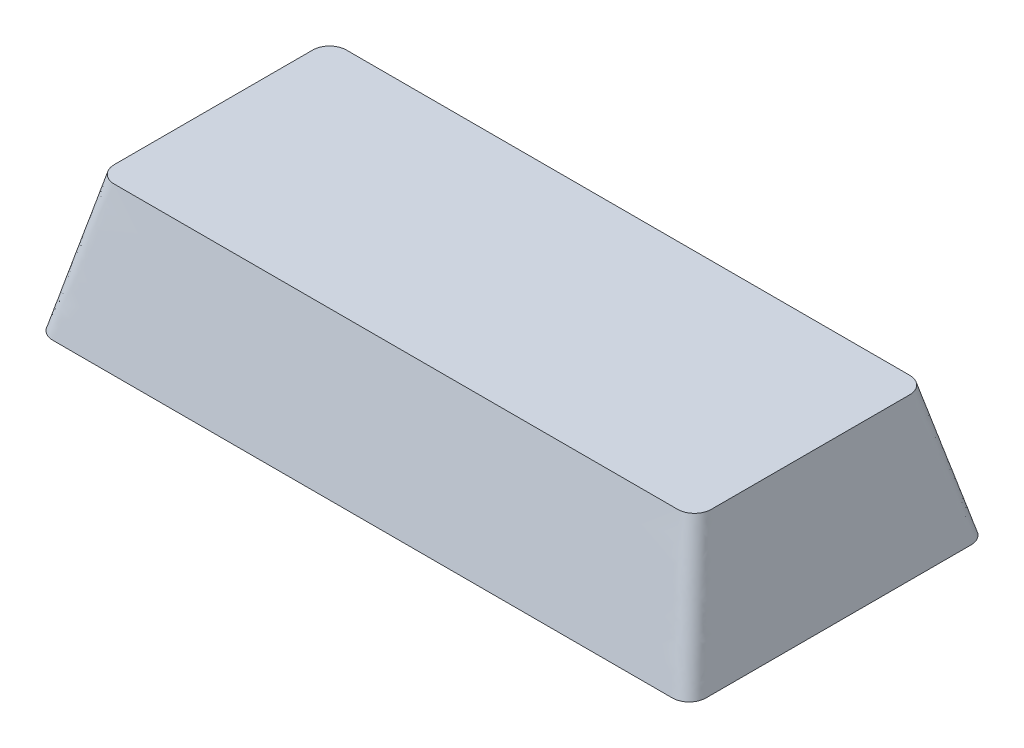
ISO-10303-21;
HEADER;
FILE_DESCRIPTION(('STEP AP214'),'2;1');
FILE_NAME('part.step','',(''),(''),'','','');
FILE_SCHEMA(('AUTOMOTIVE_DESIGN { 1 0 10303 214 1 1 1 1 }'));
ENDSEC;
DATA;
#1=APPLICATION_CONTEXT('core data for automotive mechanical design processes');
#2=APPLICATION_PROTOCOL_DEFINITION('international standard','automotive_design',2000,#1);
#3=PRODUCT_CONTEXT('',#1,'mechanical');
#4=PRODUCT('Part','Part','',(#3));
#5=PRODUCT_RELATED_PRODUCT_CATEGORY('part','',(#4));
#6=PRODUCT_DEFINITION_FORMATION('','',#4);
#7=PRODUCT_DEFINITION_CONTEXT('part definition',#1,'design');
#8=PRODUCT_DEFINITION('design','',#6,#7);
#9=PRODUCT_DEFINITION_SHAPE('','',#8);
#10=(LENGTH_UNIT() NAMED_UNIT(*) SI_UNIT(.MILLI.,.METRE.));
#11=(NAMED_UNIT(*) PLANE_ANGLE_UNIT() SI_UNIT($,.RADIAN.));
#12=(NAMED_UNIT(*) SI_UNIT($,.STERADIAN.) SOLID_ANGLE_UNIT());
#13=UNCERTAINTY_MEASURE_WITH_UNIT(LENGTH_MEASURE(1.E-05),#10,'distance_accuracy_value','');
#14=(GEOMETRIC_REPRESENTATION_CONTEXT(3) GLOBAL_UNCERTAINTY_ASSIGNED_CONTEXT((#13)) GLOBAL_UNIT_ASSIGNED_CONTEXT((#10,
#11,#12)) REPRESENTATION_CONTEXT('',''));
#15=CARTESIAN_POINT('',(0.,0.,0.));
#16=DIRECTION('',(0.,0.,1.));
#17=DIRECTION('',(1.,0.,0.));
#18=AXIS2_PLACEMENT_3D('',#15,#16,#17);
#19=CARTESIAN_POINT('',(-18.669,0.,-7.9883));
#20=DIRECTION('',(0.,-1.,0.));
#21=DIRECTION('',(0.,0.,-1.));
#22=AXIS2_PLACEMENT_3D('',#19,#20,#21);
#23=PLANE('',#22);
#24=CARTESIAN_POINT('',(-18.669,0.,-7.9883));
#25=DIRECTION('',(0.,1.,0.));
#26=DIRECTION('',(0.,0.,-1.));
#27=AXIS2_PLACEMENT_3D('',#24,#25,#26);
#28=CIRCLE('',#27,1.016);
#29=CARTESIAN_POINT('',(-18.6689999999119,0.,-9.0043));
#30=VERTEX_POINT('',#29);
#31=CARTESIAN_POINT('',(-19.685,0.,-7.9883));
#32=VERTEX_POINT('',#31);
#33=EDGE_CURVE('E324',#30,#32,#28,.T.);
#34=ORIENTED_EDGE('',*,*,#33,.F.);
#35=DIRECTION('',(-1.,0.,0.));
#36=VECTOR('',#35,1.);
#37=CARTESIAN_POINT('',(-18.669,0.,-9.0043));
#38=LINE('',#37,#36);
#39=CARTESIAN_POINT('',(18.6689999999993,0.,-9.0043));
#40=VERTEX_POINT('',#39);
#41=EDGE_CURVE('E572',#40,#30,#38,.T.);
#42=ORIENTED_EDGE('',*,*,#41,.F.);
#43=CARTESIAN_POINT('',(18.669,0.,-7.9883));
#44=DIRECTION('',(0.,1.,0.));
#45=DIRECTION('',(0.,0.,-1.));
#46=AXIS2_PLACEMENT_3D('',#43,#44,#45);
#47=CIRCLE('',#46,1.016);
#48=CARTESIAN_POINT('',(19.685,0.,-7.98829999992185));
#49=VERTEX_POINT('',#48);
#50=EDGE_CURVE('E562',#49,#40,#47,.T.);
#51=ORIENTED_EDGE('',*,*,#50,.F.);
#52=DIRECTION('',(0.,0.,-1.));
#53=VECTOR('',#52,1.);
#54=CARTESIAN_POINT('',(19.685,0.,7.9883));
#55=LINE('',#54,#53);
#56=CARTESIAN_POINT('',(19.685,0.,7.98829999998992));
#57=VERTEX_POINT('',#56);
#58=EDGE_CURVE('E552',#57,#49,#55,.T.);
#59=ORIENTED_EDGE('',*,*,#58,.F.);
#60=CARTESIAN_POINT('',(18.669,0.,7.9883));
#61=DIRECTION('',(0.,1.,0.));
#62=DIRECTION('',(0.,0.,1.));
#63=AXIS2_PLACEMENT_3D('',#60,#61,#62);
#64=CIRCLE('',#63,1.016);
#65=CARTESIAN_POINT('',(18.6689999999116,0.,9.0043));
#66=VERTEX_POINT('',#65);
#67=EDGE_CURVE('E542',#66,#57,#64,.T.);
#68=ORIENTED_EDGE('',*,*,#67,.F.);
#69=DIRECTION('',(1.,0.,0.));
#70=VECTOR('',#69,1.);
#71=CARTESIAN_POINT('',(-18.669,0.,9.0043));
#72=LINE('',#71,#70);
#73=CARTESIAN_POINT('',(-18.6689999999993,0.,9.0043));
#74=VERTEX_POINT('',#73);
#75=EDGE_CURVE('E535',#74,#66,#72,.T.);
#76=ORIENTED_EDGE('',*,*,#75,.F.);
#77=CARTESIAN_POINT('',(-18.669,0.,7.9883));
#78=DIRECTION('',(0.,1.,0.));
#79=DIRECTION('',(0.,0.,-1.));
#80=AXIS2_PLACEMENT_3D('',#77,#78,#79);
#81=CIRCLE('',#80,1.016);
#82=CARTESIAN_POINT('',(-19.685,0.,7.9883));
#83=VERTEX_POINT('',#82);
#84=EDGE_CURVE('E255',#83,#74,#81,.T.);
#85=ORIENTED_EDGE('',*,*,#84,.F.);
#86=DIRECTION('',(0.,0.,1.));
#87=VECTOR('',#86,1.);
#88=CARTESIAN_POINT('',(-19.685,0.,7.9883));
#89=LINE('',#88,#87);
#90=EDGE_CURVE('E13',#32,#83,#89,.T.);
#91=ORIENTED_EDGE('',*,*,#90,.F.);
#92=EDGE_LOOP('',(#34,#42,#51,#59,#68,#76,#85,#91));
#93=FACE_BOUND('',#92,.T.);
#94=ADVANCED_FACE('F244',(#93),#23,.T.);
#95=CARTESIAN_POINT('',(16.9799,8.001,-5.9817));
#96=DIRECTION('',(0.,-1.,0.));
#97=DIRECTION('',(0.,0.,-1.));
#98=AXIS2_PLACEMENT_3D('',#95,#96,#97);
#99=PLANE('',#98);
#100=CARTESIAN_POINT('',(16.9799,8.001,-5.9817));
#101=DIRECTION('',(0.,1.,0.));
#102=DIRECTION('',(0.,0.,-1.));
#103=AXIS2_PLACEMENT_3D('',#100,#101,#102);
#104=CIRCLE('',#103,1.016);
#105=CARTESIAN_POINT('',(17.9959,8.001,-5.98169999999999));
#106=VERTEX_POINT('',#105);
#107=CARTESIAN_POINT('',(16.9799,8.001,-6.9977));
#108=VERTEX_POINT('',#107);
#109=EDGE_CURVE('E319',#106,#108,#104,.T.);
#110=ORIENTED_EDGE('',*,*,#109,.T.);
#111=DIRECTION('',(-1.,0.,0.));
#112=VECTOR('',#111,1.);
#113=CARTESIAN_POINT('',(-16.9799,8.001,-6.9977));
#114=LINE('',#113,#112);
#115=CARTESIAN_POINT('',(-16.9799,8.001,-6.9977));
#116=VERTEX_POINT('',#115);
#117=EDGE_CURVE('E310',#108,#116,#114,.T.);
#118=ORIENTED_EDGE('',*,*,#117,.T.);
#119=CARTESIAN_POINT('',(-16.9799,8.001,-5.9817));
#120=DIRECTION('',(0.,1.,0.));
#121=DIRECTION('',(0.,0.,-1.));
#122=AXIS2_PLACEMENT_3D('',#119,#120,#121);
#123=CIRCLE('',#122,1.016);
#124=CARTESIAN_POINT('',(-17.9959,8.001,-5.98169999999999));
#125=VERTEX_POINT('',#124);
#126=EDGE_CURVE('E315',#116,#125,#123,.T.);
#127=ORIENTED_EDGE('',*,*,#126,.T.);
#128=DIRECTION('',(0.,0.,1.));
#129=VECTOR('',#128,1.);
#130=CARTESIAN_POINT('',(-17.9959,8.001,5.98169999999999));
#131=LINE('',#130,#129);
#132=CARTESIAN_POINT('',(-17.9959,8.001,5.98169999999999));
#133=VERTEX_POINT('',#132);
#134=EDGE_CURVE('E331',#125,#133,#131,.T.);
#135=ORIENTED_EDGE('',*,*,#134,.T.);
#136=CARTESIAN_POINT('',(-16.9799,8.001,5.9817));
#137=DIRECTION('',(0.,1.,0.));
#138=DIRECTION('',(0.,0.,-1.));
#139=AXIS2_PLACEMENT_3D('',#136,#137,#138);
#140=CIRCLE('',#139,1.016);
#141=CARTESIAN_POINT('',(-16.9799,8.001,6.9977));
#142=VERTEX_POINT('',#141);
#143=EDGE_CURVE('E471',#133,#142,#140,.T.);
#144=ORIENTED_EDGE('',*,*,#143,.T.);
#145=DIRECTION('',(1.,0.,0.));
#146=VECTOR('',#145,1.);
#147=CARTESIAN_POINT('',(-16.9799,8.001,6.9977));
#148=LINE('',#147,#146);
#149=CARTESIAN_POINT('',(16.9799,8.001,6.9977));
#150=VERTEX_POINT('',#149);
#151=EDGE_CURVE('E482',#142,#150,#148,.T.);
#152=ORIENTED_EDGE('',*,*,#151,.T.);
#153=CARTESIAN_POINT('',(16.9799,8.001,5.9817));
#154=DIRECTION('',(0.,1.,0.));
#155=DIRECTION('',(0.,0.,1.));
#156=AXIS2_PLACEMENT_3D('',#153,#154,#155);
#157=CIRCLE('',#156,1.016);
#158=CARTESIAN_POINT('',(17.9959,8.001,5.98169999999999));
#159=VERTEX_POINT('',#158);
#160=EDGE_CURVE('E485',#150,#159,#157,.T.);
#161=ORIENTED_EDGE('',*,*,#160,.T.);
#162=DIRECTION('',(0.,0.,-1.));
#163=VECTOR('',#162,1.);
#164=CARTESIAN_POINT('',(17.9959,8.001,5.98169999999999));
#165=LINE('',#164,#163);
#166=EDGE_CURVE('E503',#159,#106,#165,.T.);
#167=ORIENTED_EDGE('',*,*,#166,.T.);
#168=EDGE_LOOP('',(#110,#118,#127,#135,#144,#152,#161,#167));
#169=FACE_BOUND('',#168,.T.);
#170=ADVANCED_FACE('F314',(#169),#99,.F.);
#171=CARTESIAN_POINT('',(-16.9798999992069,8.001,-6.9977));
#172=CARTESIAN_POINT('',(-18.6689999991315,0.,-9.0043));
#173=CARTESIAN_POINT('',(-14.1442894390681,8.001,-6.9977));
#174=CARTESIAN_POINT('',(-15.5639740776614,0.,-9.0043));
#175=CARTESIAN_POINT('',(-8.48153394542982,8.00100000000001,-6.99769999999999));
#176=CARTESIAN_POINT('',(-9.34424108341826,0.,-9.0043));
#177=CARTESIAN_POINT('',(0.,8.00099999999999,-6.99770000000001));
#178=CARTESIAN_POINT('',(0.,0.,-9.00429999999999));
#179=CARTESIAN_POINT('',(8.4815339454298,8.001,-6.99769999999999));
#180=CARTESIAN_POINT('',(9.34424108341825,0.,-9.0043));
#181=CARTESIAN_POINT('',(14.1442894390681,8.001,-6.9977));
#182=CARTESIAN_POINT('',(15.5639740776614,0.,-9.0043));
#183=CARTESIAN_POINT('',(17.1072668605747,8.001,-6.9977));
#184=CARTESIAN_POINT('',(18.8084681657559,0.,-9.0043));
#185=CARTESIAN_POINT('',(17.3765771636546,8.001,-6.94866859660009));
#186=CARTESIAN_POINT('',(19.0707881960242,0.,-8.94785022253748));
#187=CARTESIAN_POINT('',(17.7352821964251,8.00099999999999,-6.70524238804379));
#188=CARTESIAN_POINT('',(19.3931178802567,0.,-8.73476289399683));
#189=CARTESIAN_POINT('',(17.9551707637829,8.00100000000001,-6.34797087880216));
#190=CARTESIAN_POINT('',(19.6194369617665,0.,-8.41454428049206));
#191=CARTESIAN_POINT('',(17.9959,8.001,-6.09860446192369));
#192=CARTESIAN_POINT('',(19.685,0.,-8.13980506673523));
#193=CARTESIAN_POINT('',(17.9959,8.001,-4.96866037368238));
#194=CARTESIAN_POINT('',(19.685,0.,-6.67542764538571));
#195=CARTESIAN_POINT('',(17.9959,8.001,-2.96728244688406));
#196=CARTESIAN_POINT('',(19.685,0.,-4.0224961699705));
#197=CARTESIAN_POINT('',(17.9959,8.001,0.));
#198=CARTESIAN_POINT('',(19.685,0.,0.));
#199=CARTESIAN_POINT('',(17.9959,8.001,2.96728244688407));
#200=CARTESIAN_POINT('',(19.685,0.,4.0224961699705));
#201=CARTESIAN_POINT('',(17.9959,8.001,4.96866037368238));
#202=CARTESIAN_POINT('',(19.685,0.,6.67542764538571));
#203=CARTESIAN_POINT('',(17.9959,8.001,6.09860446192369));
#204=CARTESIAN_POINT('',(19.685,0.,8.13980506673523));
#205=CARTESIAN_POINT('',(17.9551707637829,8.001,6.34797087880216));
#206=CARTESIAN_POINT('',(19.6194369617665,0.,8.41454428049207));
#207=CARTESIAN_POINT('',(17.7352821964251,8.001,6.7052423880438));
#208=CARTESIAN_POINT('',(19.3931178802567,0.,8.73476289399682));
#209=CARTESIAN_POINT('',(17.3765771636546,8.001,6.94866859660008));
#210=CARTESIAN_POINT('',(19.0707881960243,0.,8.94785022253747));
#211=CARTESIAN_POINT('',(17.1072668605747,8.001,6.9977));
#212=CARTESIAN_POINT('',(18.8084681657559,0.,9.0043));
#213=CARTESIAN_POINT('',(14.1442894390681,8.001,6.9977));
#214=CARTESIAN_POINT('',(15.5639740776614,0.,9.0043));
#215=CARTESIAN_POINT('',(8.48153394542981,8.00099999999999,6.99769999999999));
#216=CARTESIAN_POINT('',(9.34424108341824,0.,9.0043));
#217=CARTESIAN_POINT('',(0.,8.001,6.99770000000001));
#218=CARTESIAN_POINT('',(0.,0.,9.0043));
#219=CARTESIAN_POINT('',(-8.48153394542982,8.001,6.99769999999999));
#220=CARTESIAN_POINT('',(-9.34424108341826,0.,9.0043));
#221=CARTESIAN_POINT('',(-14.1442894390681,8.001,6.9977));
#222=CARTESIAN_POINT('',(-15.5639740776614,0.,9.0043));
#223=CARTESIAN_POINT('',(-17.1072668605747,8.001,6.9977));
#224=CARTESIAN_POINT('',(-18.8084681657559,0.,9.0043));
#225=CARTESIAN_POINT('',(-17.3765771636546,8.00099999999999,6.94866859660008));
#226=CARTESIAN_POINT('',(-19.0707881960243,0.,8.94785022253749));
#227=CARTESIAN_POINT('',(-17.7352821964251,8.001,6.7052423880438));
#228=CARTESIAN_POINT('',(-19.3931178802566,0.,8.73476289399682));
#229=CARTESIAN_POINT('',(-17.9551707637829,8.001,6.34797087880216));
#230=CARTESIAN_POINT('',(-19.6194369617665,0.,8.41454428049207));
#231=CARTESIAN_POINT('',(-17.9959,8.001,6.09860446192369));
#232=CARTESIAN_POINT('',(-19.685,0.,8.13980506673523));
#233=CARTESIAN_POINT('',(-17.9959,8.001,4.96866037368238));
#234=CARTESIAN_POINT('',(-19.685,0.,6.67542764538571));
#235=CARTESIAN_POINT('',(-17.9959,8.001,2.96728244688407));
#236=CARTESIAN_POINT('',(-19.685,0.,4.02249616997051));
#237=CARTESIAN_POINT('',(-17.9959,8.001,0.));
#238=CARTESIAN_POINT('',(-19.685,0.,0.));
#239=CARTESIAN_POINT('',(-17.9959,8.001,-2.96728244688407));
#240=CARTESIAN_POINT('',(-19.685,0.,-4.02249616997051));
#241=CARTESIAN_POINT('',(-17.9959,8.001,-4.96866037368238));
#242=CARTESIAN_POINT('',(-19.685,0.,-6.67542764538571));
#243=CARTESIAN_POINT('',(-17.9959,8.001,-6.09860446192369));
#244=CARTESIAN_POINT('',(-19.685,0.,-8.13980506673523));
#245=CARTESIAN_POINT('',(-17.9551707637829,8.001,-6.34797087880215));
#246=CARTESIAN_POINT('',(-19.6194369617665,0.,-8.41454428049207));
#247=CARTESIAN_POINT('',(-17.7352821964251,8.00099999999999,-6.70524238804381));
#248=CARTESIAN_POINT('',(-19.3931178802567,0.,-8.73476289399681));
#249=CARTESIAN_POINT('',(-17.3765771636546,8.00100000000001,-6.94866859660008));
#250=CARTESIAN_POINT('',(-19.0707881960243,0.,-8.94785022253749));
#251=CARTESIAN_POINT('',(-17.1072668605747,8.001,-6.9977));
#252=CARTESIAN_POINT('',(-18.8084681657559,0.,-9.0043));
#253=CARTESIAN_POINT('',(-16.9798999992069,8.001,-6.9977));
#254=CARTESIAN_POINT('',(-18.6689999991315,0.,-9.0043));
#255=B_SPLINE_SURFACE_WITH_KNOTS('',3,1,((#171,#172),(#173,#174),(#175,#176),(#177,#178),(#179,
#180),(#181,#182),(#183,#184),(#185,#186),(#187,#188),(#189,#190),(#191,#192),(#193,#194),(#195,
#196),(#197,#198),(#199,#200),(#201,#202),(#203,#204),(#205,#206),(#207,#208),(#209,#210),(#211,
#212),(#213,#214),(#215,#216),(#217,#218),(#219,#220),(#221,#222),(#223,#224),(#225,#226),(#227,
#228),(#229,#230),(#231,#232),(#233,#234),(#235,#236),(#237,#238),(#239,#240),(#241,#242),(#243,
#244),(#245,#246),(#247,#248),(#249,#250),(#251,#252),(#253,#254)),.UNSPECIFIED.,.T.,.F.,.F.,(4,
1,1,1,2,1,1,1,2,1,1,1,2,1,1,1,2,1,1,1,2,1,1,1,2,1,1,1,2,1,1,1,4),(2,2),(0.,0.0845129749452434,
0.169025949890487,0.25353892483573,0.338051899780974,0.341847961382291,0.345644022983608,
0.349440084584925,0.353236146186242,0.386131048038364,0.419025949890487,0.451920851742609,
0.484815753594732,0.488611815196049,0.492407876797366,0.496203938398683,0.5,0.584512974945243,
0.669025949890487,0.75353892483573,0.838051899780974,0.841847961382291,0.845644022983608,
0.849440084584925,0.853236146186242,0.886131048038364,0.919025949890487,0.95192085174261,
0.984815753594732,0.988611815196049,0.992407876797366,0.996203938398683,1.),(0.,1.),.UNSPECIFIED.);
#256=ORIENTED_EDGE('',*,*,#109,.F.);
#257=ORIENTED_EDGE('',*,*,#166,.F.);
#258=ORIENTED_EDGE('',*,*,#160,.F.);
#259=ORIENTED_EDGE('',*,*,#151,.F.);
#260=ORIENTED_EDGE('',*,*,#143,.F.);
#261=ORIENTED_EDGE('',*,*,#134,.F.);
#262=ORIENTED_EDGE('',*,*,#126,.F.);
#263=ORIENTED_EDGE('',*,*,#117,.F.);
#264=EDGE_LOOP('',(#256,#257,#258,#259,#260,#261,#262,#263));
#265=FACE_BOUND('',#264,.T.);
#266=ORIENTED_EDGE('',*,*,#90,.T.);
#267=ORIENTED_EDGE('',*,*,#84,.T.);
#268=ORIENTED_EDGE('',*,*,#75,.T.);
#269=ORIENTED_EDGE('',*,*,#67,.T.);
#270=ORIENTED_EDGE('',*,*,#58,.T.);
#271=ORIENTED_EDGE('',*,*,#50,.T.);
#272=ORIENTED_EDGE('',*,*,#41,.T.);
#273=ORIENTED_EDGE('',*,*,#33,.T.);
#274=EDGE_LOOP('',(#266,#267,#268,#269,#270,#271,#272,#273));
#275=FACE_BOUND('',#274,.T.);
#276=ADVANCED_FACE('F329',(#265,#275),#255,.T.);
#277=CLOSED_SHELL('',(#94,#170,#276));
#278=MANIFOLD_SOLID_BREP('B2',#277);
#279=ADVANCED_BREP_SHAPE_REPRESENTATION('',(#18,#278),#14);
#280=SHAPE_DEFINITION_REPRESENTATION(#9,#279);
ENDSEC;
END-ISO-10303-21;
